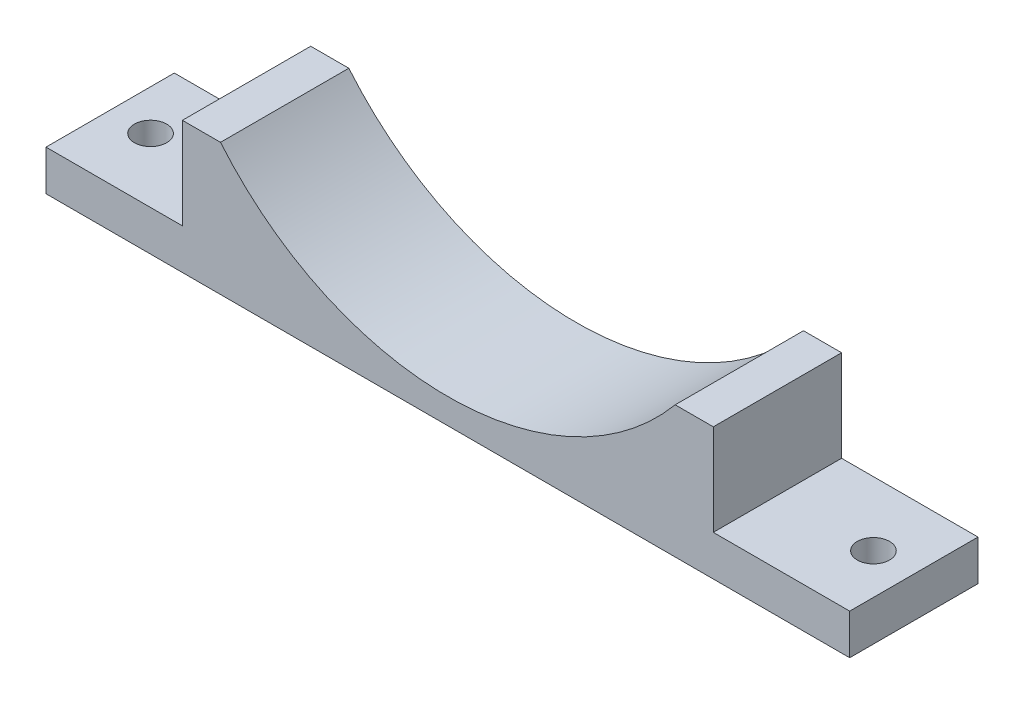
ISO-10303-21;
HEADER;
FILE_DESCRIPTION(('STEP AP214'),'2;1');
FILE_NAME('part.step','',(''),(''),'','','');
FILE_SCHEMA(('AUTOMOTIVE_DESIGN { 1 0 10303 214 1 1 1 1 }'));
ENDSEC;
DATA;
#1=APPLICATION_CONTEXT('core data for automotive mechanical design processes');
#2=APPLICATION_PROTOCOL_DEFINITION('international standard','automotive_design',2000,#1);
#3=PRODUCT_CONTEXT('',#1,'mechanical');
#4=PRODUCT('Part','Part','',(#3));
#5=PRODUCT_RELATED_PRODUCT_CATEGORY('part','',(#4));
#6=PRODUCT_DEFINITION_FORMATION('','',#4);
#7=PRODUCT_DEFINITION_CONTEXT('part definition',#1,'design');
#8=PRODUCT_DEFINITION('design','',#6,#7);
#9=PRODUCT_DEFINITION_SHAPE('','',#8);
#10=(LENGTH_UNIT() NAMED_UNIT(*) SI_UNIT(.MILLI.,.METRE.));
#11=(NAMED_UNIT(*) PLANE_ANGLE_UNIT() SI_UNIT($,.RADIAN.));
#12=(NAMED_UNIT(*) SI_UNIT($,.STERADIAN.) SOLID_ANGLE_UNIT());
#13=UNCERTAINTY_MEASURE_WITH_UNIT(LENGTH_MEASURE(1.E-05),#10,'distance_accuracy_value','');
#14=(GEOMETRIC_REPRESENTATION_CONTEXT(3) GLOBAL_UNCERTAINTY_ASSIGNED_CONTEXT((#13)) GLOBAL_UNIT_ASSIGNED_CONTEXT((#10,
#11,#12)) REPRESENTATION_CONTEXT('',''));
#15=CARTESIAN_POINT('',(0.,0.,0.));
#16=DIRECTION('',(0.,0.,1.));
#17=DIRECTION('',(1.,0.,0.));
#18=AXIS2_PLACEMENT_3D('',#15,#16,#17);
#19=CARTESIAN_POINT('',(132.09,26.0948060752684,25.4));
#20=DIRECTION('',(-1.,0.,0.));
#21=DIRECTION('',(0.,0.,1.));
#22=AXIS2_PLACEMENT_3D('',#19,#20,#21);
#23=PLANE('',#22);
#24=DIRECTION('',(0.,1.,0.));
#25=VECTOR('',#24,1.);
#26=CARTESIAN_POINT('',(132.09,26.0948060752684,0.));
#27=LINE('',#26,#25);
#28=CARTESIAN_POINT('',(132.09,8.00000000000002,0.));
#29=VERTEX_POINT('',#28);
#30=CARTESIAN_POINT('',(132.09,26.0948060752684,0.));
#31=VERTEX_POINT('',#30);
#32=EDGE_CURVE('E145',#29,#31,#27,.T.);
#33=ORIENTED_EDGE('',*,*,#32,.T.);
#34=DIRECTION('',(0.,0.,-1.));
#35=VECTOR('',#34,1.);
#36=CARTESIAN_POINT('',(132.09,26.0948060752684,25.4));
#37=LINE('',#36,#35);
#38=CARTESIAN_POINT('',(132.09,26.0948060752684,25.4));
#39=VERTEX_POINT('',#38);
#40=EDGE_CURVE('E11',#39,#31,#37,.T.);
#41=ORIENTED_EDGE('',*,*,#40,.F.);
#42=DIRECTION('',(0.,1.,0.));
#43=VECTOR('',#42,1.);
#44=CARTESIAN_POINT('',(132.09,26.0948060752684,25.4));
#45=LINE('',#44,#43);
#46=CARTESIAN_POINT('',(132.09,8.00000000000002,25.4));
#47=VERTEX_POINT('',#46);
#48=EDGE_CURVE('E164',#47,#39,#45,.T.);
#49=ORIENTED_EDGE('',*,*,#48,.F.);
#50=DIRECTION('',(0.,0.,-1.));
#51=VECTOR('',#50,1.);
#52=CARTESIAN_POINT('',(132.09,8.00000000000002,25.4));
#53=LINE('',#52,#51);
#54=EDGE_CURVE('E141',#47,#29,#53,.T.);
#55=ORIENTED_EDGE('',*,*,#54,.T.);
#56=EDGE_LOOP('',(#33,#41,#49,#55));
#57=FACE_BOUND('',#56,.T.);
#58=ADVANCED_FACE('F37',(#57),#23,.F.);
#59=CARTESIAN_POINT('',(124.545,26.0948060752684,25.4));
#60=DIRECTION('',(0.,-1.,0.));
#61=DIRECTION('',(1.,0.,0.));
#62=AXIS2_PLACEMENT_3D('',#59,#60,#61);
#63=PLANE('',#62);
#64=DIRECTION('',(-1.,0.,0.));
#65=VECTOR('',#64,1.);
#66=CARTESIAN_POINT('',(124.545,26.0948060752684,0.));
#67=LINE('',#66,#65);
#68=CARTESIAN_POINT('',(124.545,26.0948060752684,0.));
#69=VERTEX_POINT('',#68);
#70=EDGE_CURVE('E148',#31,#69,#67,.T.);
#71=ORIENTED_EDGE('',*,*,#70,.T.);
#72=DIRECTION('',(0.,0.,-1.));
#73=VECTOR('',#72,1.);
#74=CARTESIAN_POINT('',(124.545,26.0948060752684,25.4));
#75=LINE('',#74,#73);
#76=CARTESIAN_POINT('',(124.545,26.0948060752684,25.4));
#77=VERTEX_POINT('',#76);
#78=EDGE_CURVE('E45',#77,#69,#75,.T.);
#79=ORIENTED_EDGE('',*,*,#78,.F.);
#80=DIRECTION('',(-1.,0.,0.));
#81=VECTOR('',#80,1.);
#82=CARTESIAN_POINT('',(124.545,26.0948060752684,25.4));
#83=LINE('',#82,#81);
#84=EDGE_CURVE('E102',#39,#77,#83,.T.);
#85=ORIENTED_EDGE('',*,*,#84,.F.);
#86=ORIENTED_EDGE('',*,*,#40,.T.);
#87=EDGE_LOOP('',(#71,#79,#85,#86));
#88=FACE_BOUND('',#87,.T.);
#89=ADVANCED_FACE('F256',(#88),#63,.F.);
#90=CARTESIAN_POINT('',(79.545,63.545,25.4));
#91=DIRECTION('',(0.,0.,-1.));
#92=DIRECTION('',(-1.,0.,0.));
#93=AXIS2_PLACEMENT_3D('',#90,#91,#92);
#94=CYLINDRICAL_SURFACE('',#93,58.545);
#95=CARTESIAN_POINT('',(79.545,63.545,0.));
#96=DIRECTION('',(0.,0.,-1.));
#97=DIRECTION('',(1.,0.,0.));
#98=AXIS2_PLACEMENT_3D('',#95,#96,#97);
#99=CIRCLE('',#98,58.545);
#100=CARTESIAN_POINT('',(34.545,26.0948060752684,0.));
#101=VERTEX_POINT('',#100);
#102=EDGE_CURVE('E151',#69,#101,#99,.T.);
#103=ORIENTED_EDGE('',*,*,#102,.T.);
#104=DIRECTION('',(0.,0.,-1.));
#105=VECTOR('',#104,1.);
#106=CARTESIAN_POINT('',(34.545,26.0948060752684,25.4));
#107=LINE('',#106,#105);
#108=CARTESIAN_POINT('',(34.545,26.0948060752684,25.4));
#109=VERTEX_POINT('',#108);
#110=EDGE_CURVE('E177',#109,#101,#107,.T.);
#111=ORIENTED_EDGE('',*,*,#110,.F.);
#112=CARTESIAN_POINT('',(79.545,63.545,25.4));
#113=DIRECTION('',(0.,0.,-1.));
#114=DIRECTION('',(1.,0.,0.));
#115=AXIS2_PLACEMENT_3D('',#112,#113,#114);
#116=CIRCLE('',#115,58.545);
#117=EDGE_CURVE('E185',#77,#109,#116,.T.);
#118=ORIENTED_EDGE('',*,*,#117,.F.);
#119=ORIENTED_EDGE('',*,*,#78,.T.);
#120=EDGE_LOOP('',(#103,#111,#118,#119));
#121=FACE_BOUND('',#120,.T.);
#122=ADVANCED_FACE('F183',(#121),#94,.F.);
#123=CARTESIAN_POINT('',(34.545,26.0948060752684,25.4));
#124=DIRECTION('',(0.,-1.,0.));
#125=DIRECTION('',(0.,0.,-1.));
#126=AXIS2_PLACEMENT_3D('',#123,#124,#125);
#127=PLANE('',#126);
#128=DIRECTION('',(-1.,0.,0.));
#129=VECTOR('',#128,1.);
#130=CARTESIAN_POINT('',(34.545,26.0948060752684,0.));
#131=LINE('',#130,#129);
#132=CARTESIAN_POINT('',(27.,26.0948060752684,0.));
#133=VERTEX_POINT('',#132);
#134=EDGE_CURVE('E153',#101,#133,#131,.T.);
#135=ORIENTED_EDGE('',*,*,#134,.T.);
#136=DIRECTION('',(0.,0.,-1.));
#137=VECTOR('',#136,1.);
#138=CARTESIAN_POINT('',(27.,26.0948060752684,25.4));
#139=LINE('',#138,#137);
#140=CARTESIAN_POINT('',(27.,26.0948060752684,25.4));
#141=VERTEX_POINT('',#140);
#142=EDGE_CURVE('E174',#141,#133,#139,.T.);
#143=ORIENTED_EDGE('',*,*,#142,.F.);
#144=DIRECTION('',(-1.,0.,0.));
#145=VECTOR('',#144,1.);
#146=CARTESIAN_POINT('',(34.545,26.0948060752684,25.4));
#147=LINE('',#146,#145);
#148=EDGE_CURVE('E203',#109,#141,#147,.T.);
#149=ORIENTED_EDGE('',*,*,#148,.F.);
#150=ORIENTED_EDGE('',*,*,#110,.T.);
#151=EDGE_LOOP('',(#135,#143,#149,#150));
#152=FACE_BOUND('',#151,.T.);
#153=ADVANCED_FACE('F194',(#152),#127,.F.);
#154=CARTESIAN_POINT('',(27.,26.0948060752684,25.4));
#155=DIRECTION('',(1.,0.,0.));
#156=DIRECTION('',(0.,1.,0.));
#157=AXIS2_PLACEMENT_3D('',#154,#155,#156);
#158=PLANE('',#157);
#159=DIRECTION('',(0.,-1.,0.));
#160=VECTOR('',#159,1.);
#161=CARTESIAN_POINT('',(27.,26.0948060752684,0.));
#162=LINE('',#161,#160);
#163=CARTESIAN_POINT('',(27.,8.,0.));
#164=VERTEX_POINT('',#163);
#165=EDGE_CURVE('E155',#133,#164,#162,.T.);
#166=ORIENTED_EDGE('',*,*,#165,.T.);
#167=DIRECTION('',(0.,0.,-1.));
#168=VECTOR('',#167,1.);
#169=CARTESIAN_POINT('',(27.,8.,25.4));
#170=LINE('',#169,#168);
#171=CARTESIAN_POINT('',(27.,8.,25.4));
#172=VERTEX_POINT('',#171);
#173=EDGE_CURVE('E171',#172,#164,#170,.T.);
#174=ORIENTED_EDGE('',*,*,#173,.F.);
#175=DIRECTION('',(0.,-1.,0.));
#176=VECTOR('',#175,1.);
#177=CARTESIAN_POINT('',(27.,26.0948060752684,25.4));
#178=LINE('',#177,#176);
#179=EDGE_CURVE('E200',#141,#172,#178,.T.);
#180=ORIENTED_EDGE('',*,*,#179,.F.);
#181=ORIENTED_EDGE('',*,*,#142,.T.);
#182=EDGE_LOOP('',(#166,#174,#180,#181));
#183=FACE_BOUND('',#182,.T.);
#184=ADVANCED_FACE('F198',(#183),#158,.F.);
#185=CARTESIAN_POINT('',(27.,8.,25.4));
#186=DIRECTION('',(0.,-1.,0.));
#187=DIRECTION('',(1.,0.,0.));
#188=AXIS2_PLACEMENT_3D('',#185,#186,#187);
#189=PLANE('',#188);
#190=CARTESIAN_POINT('',(8.,7.99999999999999,12.7));
#191=DIRECTION('',(0.,1.,0.));
#192=DIRECTION('',(-1.,0.,0.));
#193=AXIS2_PLACEMENT_3D('',#190,#191,#192);
#194=CIRCLE('',#193,3.2);
#195=CARTESIAN_POINT('',(4.8,7.99999999999999,12.7));
#196=VERTEX_POINT('',#195);
#197=EDGE_CURVE('E217',#196,#196,#194,.T.);
#198=ORIENTED_EDGE('',*,*,#197,.F.);
#199=EDGE_LOOP('',(#198));
#200=FACE_BOUND('',#199,.T.);
#201=DIRECTION('',(-1.,0.,0.));
#202=VECTOR('',#201,1.);
#203=CARTESIAN_POINT('',(27.,8.,0.));
#204=LINE('',#203,#202);
#205=CARTESIAN_POINT('',(0.,7.99999999999998,0.));
#206=VERTEX_POINT('',#205);
#207=EDGE_CURVE('E157',#164,#206,#204,.T.);
#208=ORIENTED_EDGE('',*,*,#207,.T.);
#209=DIRECTION('',(0.,0.,-1.));
#210=VECTOR('',#209,1.);
#211=CARTESIAN_POINT('',(0.,7.99999999999998,25.4));
#212=LINE('',#211,#210);
#213=CARTESIAN_POINT('',(0.,7.99999999999998,25.4));
#214=VERTEX_POINT('',#213);
#215=EDGE_CURVE('E168',#214,#206,#212,.T.);
#216=ORIENTED_EDGE('',*,*,#215,.F.);
#217=DIRECTION('',(-1.,0.,0.));
#218=VECTOR('',#217,1.);
#219=CARTESIAN_POINT('',(27.,8.,25.4));
#220=LINE('',#219,#218);
#221=EDGE_CURVE('E202',#172,#214,#220,.T.);
#222=ORIENTED_EDGE('',*,*,#221,.F.);
#223=ORIENTED_EDGE('',*,*,#173,.T.);
#224=EDGE_LOOP('',(#208,#216,#222,#223));
#225=FACE_BOUND('',#224,.T.);
#226=ADVANCED_FACE('F232',(#200,#225),#189,.F.);
#227=CARTESIAN_POINT('',(0.,7.99999999999998,25.4));
#228=DIRECTION('',(1.,0.,0.));
#229=DIRECTION('',(0.,1.,0.));
#230=AXIS2_PLACEMENT_3D('',#227,#228,#229);
#231=PLANE('',#230);
#232=DIRECTION('',(0.,-1.,0.));
#233=VECTOR('',#232,1.);
#234=CARTESIAN_POINT('',(0.,7.99999999999998,0.));
#235=LINE('',#234,#233);
#236=CARTESIAN_POINT('',(0.,0.,0.));
#237=VERTEX_POINT('',#236);
#238=EDGE_CURVE('E159',#206,#237,#235,.T.);
#239=ORIENTED_EDGE('',*,*,#238,.T.);
#240=DIRECTION('',(0.,0.,-1.));
#241=VECTOR('',#240,1.);
#242=CARTESIAN_POINT('',(0.,0.,25.4));
#243=LINE('',#242,#241);
#244=CARTESIAN_POINT('',(0.,0.,25.4));
#245=VERTEX_POINT('',#244);
#246=EDGE_CURVE('E136',#245,#237,#243,.T.);
#247=ORIENTED_EDGE('',*,*,#246,.F.);
#248=DIRECTION('',(0.,-1.,0.));
#249=VECTOR('',#248,1.);
#250=CARTESIAN_POINT('',(0.,7.99999999999998,25.4));
#251=LINE('',#250,#249);
#252=EDGE_CURVE('E127',#214,#245,#251,.T.);
#253=ORIENTED_EDGE('',*,*,#252,.F.);
#254=ORIENTED_EDGE('',*,*,#215,.T.);
#255=EDGE_LOOP('',(#239,#247,#253,#254));
#256=FACE_BOUND('',#255,.T.);
#257=ADVANCED_FACE('F235',(#256),#231,.F.);
#258=CARTESIAN_POINT('',(0.,0.,25.4));
#259=DIRECTION('',(0.,1.,0.));
#260=DIRECTION('',(-1.,0.,0.));
#261=AXIS2_PLACEMENT_3D('',#258,#259,#260);
#262=PLANE('',#261);
#263=CARTESIAN_POINT('',(8.,0.,12.7));
#264=DIRECTION('',(0.,1.,0.));
#265=DIRECTION('',(-1.,0.,0.));
#266=AXIS2_PLACEMENT_3D('',#263,#264,#265);
#267=CIRCLE('',#266,3.2);
#268=CARTESIAN_POINT('',(4.8,0.,12.7));
#269=VERTEX_POINT('',#268);
#270=EDGE_CURVE('E149',#269,#269,#267,.T.);
#271=ORIENTED_EDGE('',*,*,#270,.T.);
#272=EDGE_LOOP('',(#271));
#273=FACE_BOUND('',#272,.T.);
#274=CARTESIAN_POINT('',(151.09,0.,12.7));
#275=DIRECTION('',(0.,1.,0.));
#276=DIRECTION('',(-1.,0.,0.));
#277=AXIS2_PLACEMENT_3D('',#274,#275,#276);
#278=CIRCLE('',#277,3.20000000000001);
#279=CARTESIAN_POINT('',(147.89,0.,12.7));
#280=VERTEX_POINT('',#279);
#281=EDGE_CURVE('E214',#280,#280,#278,.T.);
#282=ORIENTED_EDGE('',*,*,#281,.T.);
#283=EDGE_LOOP('',(#282));
#284=FACE_BOUND('',#283,.T.);
#285=DIRECTION('',(1.,0.,0.));
#286=VECTOR('',#285,1.);
#287=CARTESIAN_POINT('',(0.,0.,0.));
#288=LINE('',#287,#286);
#289=CARTESIAN_POINT('',(159.09,0.,0.));
#290=VERTEX_POINT('',#289);
#291=EDGE_CURVE('E135',#237,#290,#288,.T.);
#292=ORIENTED_EDGE('',*,*,#291,.T.);
#293=DIRECTION('',(0.,0.,-1.));
#294=VECTOR('',#293,1.);
#295=CARTESIAN_POINT('',(159.09,0.,25.4));
#296=LINE('',#295,#294);
#297=CARTESIAN_POINT('',(159.09,0.,25.4));
#298=VERTEX_POINT('',#297);
#299=EDGE_CURVE('E132',#298,#290,#296,.T.);
#300=ORIENTED_EDGE('',*,*,#299,.F.);
#301=DIRECTION('',(1.,0.,0.));
#302=VECTOR('',#301,1.);
#303=CARTESIAN_POINT('',(0.,0.,25.4));
#304=LINE('',#303,#302);
#305=EDGE_CURVE('E121',#245,#298,#304,.T.);
#306=ORIENTED_EDGE('',*,*,#305,.F.);
#307=ORIENTED_EDGE('',*,*,#246,.T.);
#308=EDGE_LOOP('',(#292,#300,#306,#307));
#309=FACE_BOUND('',#308,.T.);
#310=ADVANCED_FACE('F133',(#273,#284,#309),#262,.F.);
#311=CARTESIAN_POINT('',(159.09,8.00000000000002,25.4));
#312=DIRECTION('',(-1.,0.,0.));
#313=DIRECTION('',(0.,0.,1.));
#314=AXIS2_PLACEMENT_3D('',#311,#312,#313);
#315=PLANE('',#314);
#316=DIRECTION('',(0.,1.,0.));
#317=VECTOR('',#316,1.);
#318=CARTESIAN_POINT('',(159.09,8.00000000000002,0.));
#319=LINE('',#318,#317);
#320=CARTESIAN_POINT('',(159.09,8.00000000000002,0.));
#321=VERTEX_POINT('',#320);
#322=EDGE_CURVE('E88',#290,#321,#319,.T.);
#323=ORIENTED_EDGE('',*,*,#322,.T.);
#324=DIRECTION('',(0.,0.,-1.));
#325=VECTOR('',#324,1.);
#326=CARTESIAN_POINT('',(159.09,8.00000000000002,25.4));
#327=LINE('',#326,#325);
#328=CARTESIAN_POINT('',(159.09,8.00000000000002,25.4));
#329=VERTEX_POINT('',#328);
#330=EDGE_CURVE('E137',#329,#321,#327,.T.);
#331=ORIENTED_EDGE('',*,*,#330,.F.);
#332=DIRECTION('',(0.,1.,0.));
#333=VECTOR('',#332,1.);
#334=CARTESIAN_POINT('',(159.09,8.00000000000002,25.4));
#335=LINE('',#334,#333);
#336=EDGE_CURVE('E125',#298,#329,#335,.T.);
#337=ORIENTED_EDGE('',*,*,#336,.F.);
#338=ORIENTED_EDGE('',*,*,#299,.T.);
#339=EDGE_LOOP('',(#323,#331,#337,#338));
#340=FACE_BOUND('',#339,.T.);
#341=ADVANCED_FACE('F139',(#340),#315,.F.);
#342=CARTESIAN_POINT('',(132.09,8.00000000000002,25.4));
#343=DIRECTION('',(0.,-1.,0.));
#344=DIRECTION('',(1.,0.,0.));
#345=AXIS2_PLACEMENT_3D('',#342,#343,#344);
#346=PLANE('',#345);
#347=CARTESIAN_POINT('',(151.09,8.00000000000007,12.7));
#348=DIRECTION('',(0.,1.,0.));
#349=DIRECTION('',(-1.,0.,0.));
#350=AXIS2_PLACEMENT_3D('',#347,#348,#349);
#351=CIRCLE('',#350,3.20000000000001);
#352=CARTESIAN_POINT('',(147.89,8.00000000000007,12.7));
#353=VERTEX_POINT('',#352);
#354=EDGE_CURVE('E211',#353,#353,#351,.T.);
#355=ORIENTED_EDGE('',*,*,#354,.F.);
#356=EDGE_LOOP('',(#355));
#357=FACE_BOUND('',#356,.T.);
#358=DIRECTION('',(-1.,0.,0.));
#359=VECTOR('',#358,1.);
#360=CARTESIAN_POINT('',(132.09,8.00000000000002,0.));
#361=LINE('',#360,#359);
#362=EDGE_CURVE('E94',#321,#29,#361,.T.);
#363=ORIENTED_EDGE('',*,*,#362,.T.);
#364=ORIENTED_EDGE('',*,*,#54,.F.);
#365=DIRECTION('',(-1.,0.,0.));
#366=VECTOR('',#365,1.);
#367=CARTESIAN_POINT('',(132.09,8.00000000000002,25.4));
#368=LINE('',#367,#366);
#369=EDGE_CURVE('E53',#329,#47,#368,.T.);
#370=ORIENTED_EDGE('',*,*,#369,.F.);
#371=ORIENTED_EDGE('',*,*,#330,.T.);
#372=EDGE_LOOP('',(#363,#364,#370,#371));
#373=FACE_BOUND('',#372,.T.);
#374=ADVANCED_FACE('F243',(#357,#373),#346,.F.);
#375=CARTESIAN_POINT('',(79.545,63.545,25.4));
#376=DIRECTION('',(0.,0.,1.));
#377=DIRECTION('',(1.,0.,0.));
#378=AXIS2_PLACEMENT_3D('',#375,#376,#377);
#379=PLANE('',#378);
#380=ORIENTED_EDGE('',*,*,#48,.T.);
#381=ORIENTED_EDGE('',*,*,#84,.T.);
#382=ORIENTED_EDGE('',*,*,#117,.T.);
#383=ORIENTED_EDGE('',*,*,#148,.T.);
#384=ORIENTED_EDGE('',*,*,#179,.T.);
#385=ORIENTED_EDGE('',*,*,#221,.T.);
#386=ORIENTED_EDGE('',*,*,#252,.T.);
#387=ORIENTED_EDGE('',*,*,#305,.T.);
#388=ORIENTED_EDGE('',*,*,#336,.T.);
#389=ORIENTED_EDGE('',*,*,#369,.T.);
#390=EDGE_LOOP('',(#380,#381,#382,#383,#384,#385,#386,#387,#388,#389));
#391=FACE_BOUND('',#390,.T.);
#392=ADVANCED_FACE('F123',(#391),#379,.T.);
#393=CARTESIAN_POINT('',(79.545,63.545,0.));
#394=DIRECTION('',(0.,0.,1.));
#395=DIRECTION('',(1.,0.,0.));
#396=AXIS2_PLACEMENT_3D('',#393,#394,#395);
#397=PLANE('',#396);
#398=ORIENTED_EDGE('',*,*,#32,.F.);
#399=ORIENTED_EDGE('',*,*,#362,.F.);
#400=ORIENTED_EDGE('',*,*,#322,.F.);
#401=ORIENTED_EDGE('',*,*,#291,.F.);
#402=ORIENTED_EDGE('',*,*,#238,.F.);
#403=ORIENTED_EDGE('',*,*,#207,.F.);
#404=ORIENTED_EDGE('',*,*,#165,.F.);
#405=ORIENTED_EDGE('',*,*,#134,.F.);
#406=ORIENTED_EDGE('',*,*,#102,.F.);
#407=ORIENTED_EDGE('',*,*,#70,.F.);
#408=EDGE_LOOP('',(#398,#399,#400,#401,#402,#403,#404,#405,#406,#407));
#409=FACE_BOUND('',#408,.T.);
#410=ADVANCED_FACE('F189',(#409),#397,.F.);
#411=CARTESIAN_POINT('',(151.09,0.,12.7));
#412=DIRECTION('',(0.,1.,0.));
#413=DIRECTION('',(-1.,0.,0.));
#414=AXIS2_PLACEMENT_3D('',#411,#412,#413);
#415=CYLINDRICAL_SURFACE('',#414,3.20000000000001);
#416=ORIENTED_EDGE('',*,*,#281,.F.);
#417=EDGE_LOOP('',(#416));
#418=FACE_BOUND('',#417,.T.);
#419=ORIENTED_EDGE('',*,*,#354,.T.);
#420=EDGE_LOOP('',(#419));
#421=FACE_BOUND('',#420,.T.);
#422=ADVANCED_FACE('F228',(#418,#421),#415,.F.);
#423=CARTESIAN_POINT('',(8.,0.,12.7));
#424=DIRECTION('',(0.,1.,0.));
#425=DIRECTION('',(-1.,0.,0.));
#426=AXIS2_PLACEMENT_3D('',#423,#424,#425);
#427=CYLINDRICAL_SURFACE('',#426,3.2);
#428=ORIENTED_EDGE('',*,*,#270,.F.);
#429=EDGE_LOOP('',(#428));
#430=FACE_BOUND('',#429,.T.);
#431=ORIENTED_EDGE('',*,*,#197,.T.);
#432=EDGE_LOOP('',(#431));
#433=FACE_BOUND('',#432,.T.);
#434=ADVANCED_FACE('F225',(#430,#433),#427,.F.);
#435=CLOSED_SHELL('',(#58,#89,#122,#153,#184,#226,#257,#310,#341,#374,#392,#410,#422,#434));
#436=MANIFOLD_SOLID_BREP('B2',#435);
#437=ADVANCED_BREP_SHAPE_REPRESENTATION('',(#18,#436),#14);
#438=SHAPE_DEFINITION_REPRESENTATION(#9,#437);
ENDSEC;
END-ISO-10303-21;
